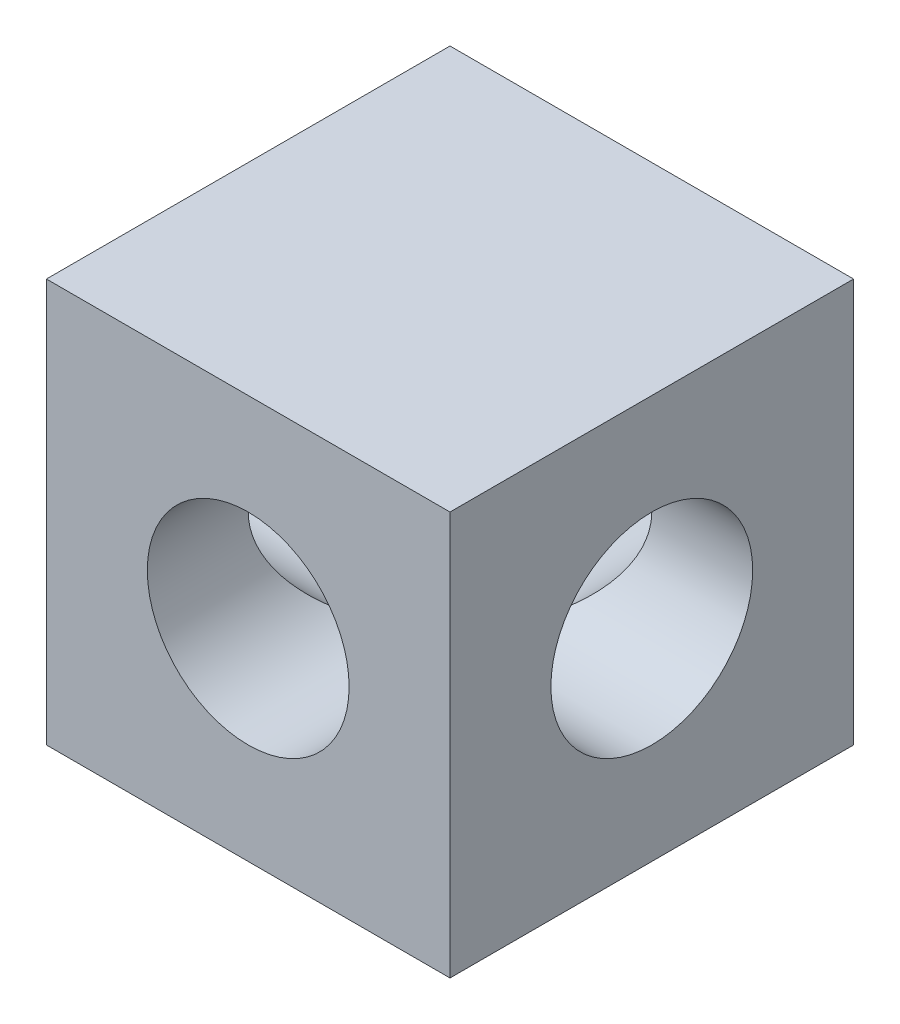
ISO-10303-21;
HEADER;
FILE_DESCRIPTION(('STEP AP214'),'2;1');
FILE_NAME('part.step','',(''),(''),'','','');
FILE_SCHEMA(('AUTOMOTIVE_DESIGN { 1 0 10303 214 1 1 1 1 }'));
ENDSEC;
DATA;
#1=APPLICATION_CONTEXT('core data for automotive mechanical design processes');
#2=APPLICATION_PROTOCOL_DEFINITION('international standard','automotive_design',2000,#1);
#3=PRODUCT_CONTEXT('',#1,'mechanical');
#4=PRODUCT('Part','Part','',(#3));
#5=PRODUCT_RELATED_PRODUCT_CATEGORY('part','',(#4));
#6=PRODUCT_DEFINITION_FORMATION('','',#4);
#7=PRODUCT_DEFINITION_CONTEXT('part definition',#1,'design');
#8=PRODUCT_DEFINITION('design','',#6,#7);
#9=PRODUCT_DEFINITION_SHAPE('','',#8);
#10=(LENGTH_UNIT() NAMED_UNIT(*) SI_UNIT(.MILLI.,.METRE.));
#11=(NAMED_UNIT(*) PLANE_ANGLE_UNIT() SI_UNIT($,.RADIAN.));
#12=(NAMED_UNIT(*) SI_UNIT($,.STERADIAN.) SOLID_ANGLE_UNIT());
#13=UNCERTAINTY_MEASURE_WITH_UNIT(LENGTH_MEASURE(1.E-05),#10,'distance_accuracy_value','');
#14=(GEOMETRIC_REPRESENTATION_CONTEXT(3) GLOBAL_UNCERTAINTY_ASSIGNED_CONTEXT((#13)) GLOBAL_UNIT_ASSIGNED_CONTEXT((#10,
#11,#12)) REPRESENTATION_CONTEXT('',''));
#15=CARTESIAN_POINT('',(0.,0.,0.));
#16=DIRECTION('',(0.,0.,1.));
#17=DIRECTION('',(1.,0.,0.));
#18=AXIS2_PLACEMENT_3D('',#15,#16,#17);
#19=CARTESIAN_POINT('',(0.,0.,0.));
#20=DIRECTION('',(0.,0.,1.));
#21=DIRECTION('',(1.,0.,0.));
#22=AXIS2_PLACEMENT_3D('',#19,#20,#21);
#23=CYLINDRICAL_SURFACE('',#22,5.);
#24=CARTESIAN_POINT('',(0.,0.,20.));
#25=DIRECTION('',(0.,0.,1.));
#26=DIRECTION('',(1.,0.,0.));
#27=AXIS2_PLACEMENT_3D('',#24,#25,#26);
#28=CIRCLE('',#27,5.);
#29=CARTESIAN_POINT('',(5.,0.,20.));
#30=VERTEX_POINT('',#29);
#31=EDGE_CURVE('E124',#30,#30,#28,.T.);
#32=ORIENTED_EDGE('',*,*,#31,.T.);
#33=EDGE_LOOP('',(#32));
#34=FACE_BOUND('',#33,.T.);
#35=CARTESIAN_POINT('',(0.,0.,10.));
#36=DIRECTION('',(-0.707106781186547,0.,0.707106781186547));
#37=DIRECTION('',(0.707106781186547,0.,0.707106781186547));
#38=AXIS2_PLACEMENT_3D('',#35,#36,#37);
#39=ELLIPSE('',#38,7.07106781186547,5.);
#40=CARTESIAN_POINT('',(0.,5.,10.));
#41=VERTEX_POINT('',#40);
#42=CARTESIAN_POINT('',(0.,-5.,10.));
#43=VERTEX_POINT('',#42);
#44=EDGE_CURVE('E45',#41,#43,#39,.F.);
#45=ORIENTED_EDGE('',*,*,#44,.T.);
#46=CARTESIAN_POINT('',(0.,0.,10.));
#47=DIRECTION('',(0.707106781186547,0.,0.707106781186547));
#48=DIRECTION('',(-0.707106781186547,0.,0.707106781186547));
#49=AXIS2_PLACEMENT_3D('',#46,#47,#48);
#50=ELLIPSE('',#49,7.07106781186547,5.);
#51=EDGE_CURVE('E11',#43,#41,#50,.F.);
#52=ORIENTED_EDGE('',*,*,#51,.T.);
#53=EDGE_LOOP('',(#45,#52));
#54=FACE_BOUND('',#53,.T.);
#55=ADVANCED_FACE('F32',(#34,#54),#23,.F.);
#56=CARTESIAN_POINT('',(10.,-10.,20.));
#57=DIRECTION('',(-1.,0.,0.));
#58=DIRECTION('',(0.,0.,1.));
#59=AXIS2_PLACEMENT_3D('',#56,#57,#58);
#60=PLANE('',#59);
#61=CARTESIAN_POINT('',(10.,0.,10.));
#62=DIRECTION('',(1.,0.,0.));
#63=DIRECTION('',(0.,0.,-1.));
#64=AXIS2_PLACEMENT_3D('',#61,#62,#63);
#65=CIRCLE('',#64,5.);
#66=CARTESIAN_POINT('',(10.,0.,5.));
#67=VERTEX_POINT('',#66);
#68=EDGE_CURVE('E130',#67,#67,#65,.T.);
#69=ORIENTED_EDGE('',*,*,#68,.F.);
#70=EDGE_LOOP('',(#69));
#71=FACE_BOUND('',#70,.T.);
#72=DIRECTION('',(0.,1.,0.));
#73=VECTOR('',#72,1.);
#74=CARTESIAN_POINT('',(10.,-10.,0.));
#75=LINE('',#74,#73);
#76=CARTESIAN_POINT('',(10.,-10.,0.));
#77=VERTEX_POINT('',#76);
#78=CARTESIAN_POINT('',(10.,10.,0.));
#79=VERTEX_POINT('',#78);
#80=EDGE_CURVE('E115',#77,#79,#75,.T.);
#81=ORIENTED_EDGE('',*,*,#80,.T.);
#82=DIRECTION('',(0.,0.,-1.));
#83=VECTOR('',#82,1.);
#84=CARTESIAN_POINT('',(10.,10.,20.));
#85=LINE('',#84,#83);
#86=CARTESIAN_POINT('',(10.,10.,20.));
#87=VERTEX_POINT('',#86);
#88=EDGE_CURVE('E96',#87,#79,#85,.T.);
#89=ORIENTED_EDGE('',*,*,#88,.F.);
#90=DIRECTION('',(0.,1.,0.));
#91=VECTOR('',#90,1.);
#92=CARTESIAN_POINT('',(10.,-10.,20.));
#93=LINE('',#92,#91);
#94=CARTESIAN_POINT('',(10.,-10.,20.));
#95=VERTEX_POINT('',#94);
#96=EDGE_CURVE('E110',#95,#87,#93,.T.);
#97=ORIENTED_EDGE('',*,*,#96,.F.);
#98=DIRECTION('',(0.,0.,-1.));
#99=VECTOR('',#98,1.);
#100=CARTESIAN_POINT('',(10.,-10.,20.));
#101=LINE('',#100,#99);
#102=EDGE_CURVE('E107',#95,#77,#101,.T.);
#103=ORIENTED_EDGE('',*,*,#102,.T.);
#104=EDGE_LOOP('',(#81,#89,#97,#103));
#105=FACE_BOUND('',#104,.T.);
#106=ADVANCED_FACE('F34',(#71,#105),#60,.F.);
#107=CARTESIAN_POINT('',(-10.,10.,20.));
#108=DIRECTION('',(0.,-1.,0.));
#109=DIRECTION('',(0.,0.,-1.));
#110=AXIS2_PLACEMENT_3D('',#107,#108,#109);
#111=PLANE('',#110);
#112=DIRECTION('',(-1.,0.,0.));
#113=VECTOR('',#112,1.);
#114=CARTESIAN_POINT('',(-10.,10.,0.));
#115=LINE('',#114,#113);
#116=CARTESIAN_POINT('',(-10.,10.,0.));
#117=VERTEX_POINT('',#116);
#118=EDGE_CURVE('E113',#79,#117,#115,.T.);
#119=ORIENTED_EDGE('',*,*,#118,.T.);
#120=DIRECTION('',(0.,0.,-1.));
#121=VECTOR('',#120,1.);
#122=CARTESIAN_POINT('',(-10.,10.,20.));
#123=LINE('',#122,#121);
#124=CARTESIAN_POINT('',(-10.,10.,20.));
#125=VERTEX_POINT('',#124);
#126=EDGE_CURVE('E102',#125,#117,#123,.T.);
#127=ORIENTED_EDGE('',*,*,#126,.F.);
#128=DIRECTION('',(-1.,0.,0.));
#129=VECTOR('',#128,1.);
#130=CARTESIAN_POINT('',(-10.,10.,20.));
#131=LINE('',#130,#129);
#132=EDGE_CURVE('E83',#87,#125,#131,.T.);
#133=ORIENTED_EDGE('',*,*,#132,.F.);
#134=ORIENTED_EDGE('',*,*,#88,.T.);
#135=EDGE_LOOP('',(#119,#127,#133,#134));
#136=FACE_BOUND('',#135,.T.);
#137=ADVANCED_FACE('F151',(#136),#111,.F.);
#138=CARTESIAN_POINT('',(-10.,-10.,20.));
#139=DIRECTION('',(1.,0.,0.));
#140=DIRECTION('',(0.,0.,-1.));
#141=AXIS2_PLACEMENT_3D('',#138,#139,#140);
#142=PLANE('',#141);
#143=CARTESIAN_POINT('',(-10.,0.,10.));
#144=DIRECTION('',(1.,0.,0.));
#145=DIRECTION('',(0.,0.,-1.));
#146=AXIS2_PLACEMENT_3D('',#143,#144,#145);
#147=CIRCLE('',#146,5.);
#148=CARTESIAN_POINT('',(-10.,0.,5.));
#149=VERTEX_POINT('',#148);
#150=EDGE_CURVE('E127',#149,#149,#147,.T.);
#151=ORIENTED_EDGE('',*,*,#150,.T.);
#152=EDGE_LOOP('',(#151));
#153=FACE_BOUND('',#152,.T.);
#154=DIRECTION('',(0.,-1.,0.));
#155=VECTOR('',#154,1.);
#156=CARTESIAN_POINT('',(-10.,-10.,0.));
#157=LINE('',#156,#155);
#158=CARTESIAN_POINT('',(-10.,-10.,0.));
#159=VERTEX_POINT('',#158);
#160=EDGE_CURVE('E111',#117,#159,#157,.T.);
#161=ORIENTED_EDGE('',*,*,#160,.T.);
#162=DIRECTION('',(0.,0.,-1.));
#163=VECTOR('',#162,1.);
#164=CARTESIAN_POINT('',(-10.,-10.,20.));
#165=LINE('',#164,#163);
#166=CARTESIAN_POINT('',(-10.,-10.,20.));
#167=VERTEX_POINT('',#166);
#168=EDGE_CURVE('E105',#167,#159,#165,.T.);
#169=ORIENTED_EDGE('',*,*,#168,.F.);
#170=DIRECTION('',(0.,-1.,0.));
#171=VECTOR('',#170,1.);
#172=CARTESIAN_POINT('',(-10.,-10.,20.));
#173=LINE('',#172,#171);
#174=EDGE_CURVE('E120',#125,#167,#173,.T.);
#175=ORIENTED_EDGE('',*,*,#174,.F.);
#176=ORIENTED_EDGE('',*,*,#126,.T.);
#177=EDGE_LOOP('',(#161,#169,#175,#176));
#178=FACE_BOUND('',#177,.T.);
#179=ADVANCED_FACE('F136',(#153,#178),#142,.F.);
#180=CARTESIAN_POINT('',(-10.,-10.,20.));
#181=DIRECTION('',(0.,1.,0.));
#182=DIRECTION('',(0.,0.,1.));
#183=AXIS2_PLACEMENT_3D('',#180,#181,#182);
#184=PLANE('',#183);
#185=DIRECTION('',(1.,0.,0.));
#186=VECTOR('',#185,1.);
#187=CARTESIAN_POINT('',(-10.,-10.,0.));
#188=LINE('',#187,#186);
#189=EDGE_CURVE('E75',#159,#77,#188,.T.);
#190=ORIENTED_EDGE('',*,*,#189,.T.);
#191=ORIENTED_EDGE('',*,*,#102,.F.);
#192=DIRECTION('',(1.,0.,0.));
#193=VECTOR('',#192,1.);
#194=CARTESIAN_POINT('',(-10.,-10.,20.));
#195=LINE('',#194,#193);
#196=EDGE_CURVE('E54',#167,#95,#195,.T.);
#197=ORIENTED_EDGE('',*,*,#196,.F.);
#198=ORIENTED_EDGE('',*,*,#168,.T.);
#199=EDGE_LOOP('',(#190,#191,#197,#198));
#200=FACE_BOUND('',#199,.T.);
#201=ADVANCED_FACE('F165',(#200),#184,.F.);
#202=CARTESIAN_POINT('',(0.,0.,20.));
#203=DIRECTION('',(0.,0.,-1.));
#204=DIRECTION('',(-1.,0.,0.));
#205=AXIS2_PLACEMENT_3D('',#202,#203,#204);
#206=PLANE('',#205);
#207=ORIENTED_EDGE('',*,*,#31,.F.);
#208=EDGE_LOOP('',(#207));
#209=FACE_BOUND('',#208,.T.);
#210=ORIENTED_EDGE('',*,*,#96,.T.);
#211=ORIENTED_EDGE('',*,*,#132,.T.);
#212=ORIENTED_EDGE('',*,*,#174,.T.);
#213=ORIENTED_EDGE('',*,*,#196,.T.);
#214=EDGE_LOOP('',(#210,#211,#212,#213));
#215=FACE_BOUND('',#214,.T.);
#216=ADVANCED_FACE('F159',(#209,#215),#206,.F.);
#217=CARTESIAN_POINT('',(0.,0.,0.));
#218=DIRECTION('',(0.,0.,-1.));
#219=DIRECTION('',(-1.,0.,0.));
#220=AXIS2_PLACEMENT_3D('',#217,#218,#219);
#221=PLANE('',#220);
#222=CARTESIAN_POINT('',(0.,0.,0.));
#223=DIRECTION('',(0.,0.,1.));
#224=DIRECTION('',(1.,0.,0.));
#225=AXIS2_PLACEMENT_3D('',#222,#223,#224);
#226=CIRCLE('',#225,5.);
#227=CARTESIAN_POINT('',(5.,0.,0.));
#228=VERTEX_POINT('',#227);
#229=EDGE_CURVE('E118',#228,#228,#226,.T.);
#230=ORIENTED_EDGE('',*,*,#229,.T.);
#231=EDGE_LOOP('',(#230));
#232=FACE_BOUND('',#231,.T.);
#233=ORIENTED_EDGE('',*,*,#80,.F.);
#234=ORIENTED_EDGE('',*,*,#189,.F.);
#235=ORIENTED_EDGE('',*,*,#160,.F.);
#236=ORIENTED_EDGE('',*,*,#118,.F.);
#237=EDGE_LOOP('',(#233,#234,#235,#236));
#238=FACE_BOUND('',#237,.T.);
#239=ADVANCED_FACE('F155',(#232,#238),#221,.T.);
#240=CARTESIAN_POINT('',(0.,0.,10.));
#241=DIRECTION('',(-0.707106781186547,0.,0.707106781186547));
#242=DIRECTION('',(0.707106781186547,0.,0.707106781186547));
#243=AXIS2_PLACEMENT_3D('',#240,#241,#242);
#244=ELLIPSE('',#243,7.07106781186547,5.);
#245=EDGE_CURVE('E89',#41,#43,#244,.T.);
#246=ORIENTED_EDGE('',*,*,#245,.T.);
#247=CARTESIAN_POINT('',(0.,0.,10.));
#248=DIRECTION('',(0.707106781186547,0.,0.707106781186547));
#249=DIRECTION('',(-0.707106781186547,0.,0.707106781186547));
#250=AXIS2_PLACEMENT_3D('',#247,#248,#249);
#251=ELLIPSE('',#250,7.07106781186547,5.);
#252=EDGE_CURVE('E40',#43,#41,#251,.T.);
#253=ORIENTED_EDGE('',*,*,#252,.T.);
#254=EDGE_LOOP('',(#246,#253));
#255=FACE_BOUND('',#254,.T.);
#256=ORIENTED_EDGE('',*,*,#229,.F.);
#257=EDGE_LOOP('',(#256));
#258=FACE_BOUND('',#257,.T.);
#259=ADVANCED_FACE('F98',(#255,#258),#23,.F.);
#260=CARTESIAN_POINT('',(-10.,0.,10.));
#261=DIRECTION('',(1.,0.,0.));
#262=DIRECTION('',(0.,0.,-1.));
#263=AXIS2_PLACEMENT_3D('',#260,#261,#262);
#264=CYLINDRICAL_SURFACE('',#263,5.);
#265=ORIENTED_EDGE('',*,*,#68,.T.);
#266=EDGE_LOOP('',(#265));
#267=FACE_BOUND('',#266,.T.);
#268=ORIENTED_EDGE('',*,*,#44,.F.);
#269=ORIENTED_EDGE('',*,*,#252,.F.);
#270=EDGE_LOOP('',(#268,#269));
#271=FACE_BOUND('',#270,.T.);
#272=ADVANCED_FACE('F95',(#267,#271),#264,.F.);
#273=ORIENTED_EDGE('',*,*,#150,.F.);
#274=EDGE_LOOP('',(#273));
#275=FACE_BOUND('',#274,.T.);
#276=ORIENTED_EDGE('',*,*,#245,.F.);
#277=ORIENTED_EDGE('',*,*,#51,.F.);
#278=EDGE_LOOP('',(#276,#277));
#279=FACE_BOUND('',#278,.T.);
#280=ADVANCED_FACE('F90',(#275,#279),#264,.F.);
#281=CLOSED_SHELL('',(#55,#106,#137,#179,#201,#216,#239,#259,#272,#280));
#282=MANIFOLD_SOLID_BREP('B2',#281);
#283=ADVANCED_BREP_SHAPE_REPRESENTATION('',(#18,#282),#14);
#284=SHAPE_DEFINITION_REPRESENTATION(#9,#283);
ENDSEC;
END-ISO-10303-21;
